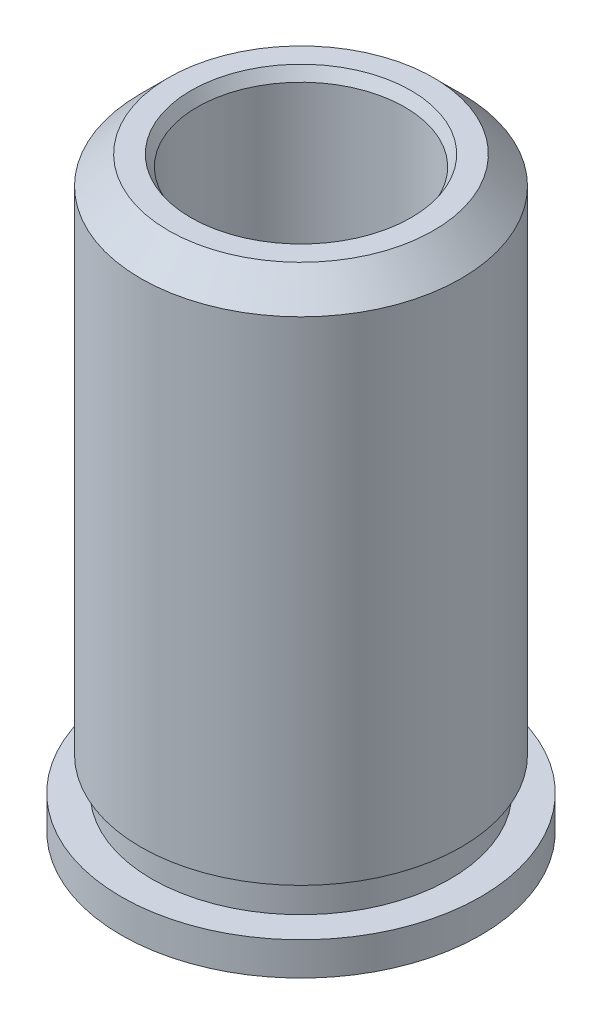
ISO-10303-21;
HEADER;
FILE_DESCRIPTION(('STEP AP214'),'2;1');
FILE_NAME('part.step','',(''),(''),'','','');
FILE_SCHEMA(('AUTOMOTIVE_DESIGN { 1 0 10303 214 1 1 1 1 }'));
ENDSEC;
DATA;
#1=APPLICATION_CONTEXT('core data for automotive mechanical design processes');
#2=APPLICATION_PROTOCOL_DEFINITION('international standard','automotive_design',2000,#1);
#3=PRODUCT_CONTEXT('',#1,'mechanical');
#4=PRODUCT('Part','Part','',(#3));
#5=PRODUCT_RELATED_PRODUCT_CATEGORY('part','',(#4));
#6=PRODUCT_DEFINITION_FORMATION('','',#4);
#7=PRODUCT_DEFINITION_CONTEXT('part definition',#1,'design');
#8=PRODUCT_DEFINITION('design','',#6,#7);
#9=PRODUCT_DEFINITION_SHAPE('','',#8);
#10=(LENGTH_UNIT() NAMED_UNIT(*) SI_UNIT(.MILLI.,.METRE.));
#11=(NAMED_UNIT(*) PLANE_ANGLE_UNIT() SI_UNIT($,.RADIAN.));
#12=(NAMED_UNIT(*) SI_UNIT($,.STERADIAN.) SOLID_ANGLE_UNIT());
#13=UNCERTAINTY_MEASURE_WITH_UNIT(LENGTH_MEASURE(1.E-05),#10,'distance_accuracy_value','');
#14=(GEOMETRIC_REPRESENTATION_CONTEXT(3) GLOBAL_UNCERTAINTY_ASSIGNED_CONTEXT((#13)) GLOBAL_UNIT_ASSIGNED_CONTEXT((#10,
#11,#12)) REPRESENTATION_CONTEXT('',''));
#15=CARTESIAN_POINT('',(0.,0.,0.));
#16=DIRECTION('',(0.,0.,1.));
#17=DIRECTION('',(1.,0.,0.));
#18=AXIS2_PLACEMENT_3D('',#15,#16,#17);
#19=CARTESIAN_POINT('',(0.,6.731,0.));
#20=DIRECTION('',(0.,1.,0.));
#21=DIRECTION('',(0.,0.,1.));
#22=AXIS2_PLACEMENT_3D('',#19,#20,#21);
#23=CYLINDRICAL_SURFACE('',#22,4.1275);
#24=CARTESIAN_POINT('',(0.,-6.731,0.));
#25=DIRECTION('',(0.,1.,0.));
#26=DIRECTION('',(0.,0.,1.));
#27=AXIS2_PLACEMENT_3D('',#24,#25,#26);
#28=CIRCLE('',#27,4.1275);
#29=CARTESIAN_POINT('',(0.,-6.731,4.1275));
#30=VERTEX_POINT('',#29);
#31=EDGE_CURVE('E51',#30,#30,#28,.T.);
#32=ORIENTED_EDGE('',*,*,#31,.T.);
#33=EDGE_LOOP('',(#32));
#34=FACE_BOUND('',#33,.T.);
#35=CARTESIAN_POINT('',(0.,-5.969,0.));
#36=DIRECTION('',(0.,1.,0.));
#37=DIRECTION('',(0.,0.,1.));
#38=AXIS2_PLACEMENT_3D('',#35,#36,#37);
#39=CIRCLE('',#38,4.1275);
#40=CARTESIAN_POINT('',(0.,-5.969,4.1275));
#41=VERTEX_POINT('',#40);
#42=EDGE_CURVE('E9',#41,#41,#39,.T.);
#43=ORIENTED_EDGE('',*,*,#42,.F.);
#44=EDGE_LOOP('',(#43));
#45=FACE_BOUND('',#44,.T.);
#46=ADVANCED_FACE('F14',(#34,#45),#23,.T.);
#47=CARTESIAN_POINT('',(2.06375,-5.969,0.));
#48=DIRECTION('',(0.,1.,0.));
#49=DIRECTION('',(0.,0.,1.));
#50=AXIS2_PLACEMENT_3D('',#47,#48,#49);
#51=PLANE('',#50);
#52=ORIENTED_EDGE('',*,*,#42,.T.);
#53=EDGE_LOOP('',(#52));
#54=FACE_BOUND('',#53,.T.);
#55=CARTESIAN_POINT('',(0.,-5.969,0.));
#56=DIRECTION('',(0.,1.,0.));
#57=DIRECTION('',(0.,0.,1.));
#58=AXIS2_PLACEMENT_3D('',#55,#56,#57);
#59=CIRCLE('',#58,3.42265);
#60=CARTESIAN_POINT('',(0.,-5.969,3.42265));
#61=VERTEX_POINT('',#60);
#62=EDGE_CURVE('E20',#61,#61,#59,.T.);
#63=ORIENTED_EDGE('',*,*,#62,.F.);
#64=EDGE_LOOP('',(#63));
#65=FACE_BOUND('',#64,.T.);
#66=ADVANCED_FACE('F77',(#54,#65),#51,.T.);
#67=CARTESIAN_POINT('',(0.,6.731,0.));
#68=DIRECTION('',(0.,1.,0.));
#69=DIRECTION('',(0.,0.,1.));
#70=AXIS2_PLACEMENT_3D('',#67,#68,#69);
#71=CYLINDRICAL_SURFACE('',#70,3.42265);
#72=ORIENTED_EDGE('',*,*,#62,.T.);
#73=EDGE_LOOP('',(#72));
#74=FACE_BOUND('',#73,.T.);
#75=CARTESIAN_POINT('',(0.,-5.207,0.));
#76=DIRECTION('',(0.,1.,0.));
#77=DIRECTION('',(0.,0.,1.));
#78=AXIS2_PLACEMENT_3D('',#75,#76,#77);
#79=CIRCLE('',#78,3.42265);
#80=CARTESIAN_POINT('',(0.,-5.207,3.42265));
#81=VERTEX_POINT('',#80);
#82=EDGE_CURVE('E24',#81,#81,#79,.T.);
#83=ORIENTED_EDGE('',*,*,#82,.F.);
#84=EDGE_LOOP('',(#83));
#85=FACE_BOUND('',#84,.T.);
#86=ADVANCED_FACE('F82',(#74,#85),#71,.T.);
#87=CARTESIAN_POINT('',(2.06375,-5.207,0.));
#88=DIRECTION('',(0.,-1.,0.));
#89=DIRECTION('',(0.,0.,-1.));
#90=AXIS2_PLACEMENT_3D('',#87,#88,#89);
#91=PLANE('',#90);
#92=ORIENTED_EDGE('',*,*,#82,.T.);
#93=EDGE_LOOP('',(#92));
#94=FACE_BOUND('',#93,.T.);
#95=CARTESIAN_POINT('',(0.,-5.207,0.));
#96=DIRECTION('',(0.,1.,0.));
#97=DIRECTION('',(0.,0.,1.));
#98=AXIS2_PLACEMENT_3D('',#95,#96,#97);
#99=CIRCLE('',#98,3.67665);
#100=CARTESIAN_POINT('',(0.,-5.207,3.67665));
#101=VERTEX_POINT('',#100);
#102=EDGE_CURVE('E28',#101,#101,#99,.T.);
#103=ORIENTED_EDGE('',*,*,#102,.F.);
#104=EDGE_LOOP('',(#103));
#105=FACE_BOUND('',#104,.T.);
#106=ADVANCED_FACE('F87',(#94,#105),#91,.T.);
#107=CARTESIAN_POINT('',(0.,6.731,0.));
#108=DIRECTION('',(0.,1.,0.));
#109=DIRECTION('',(0.,0.,1.));
#110=AXIS2_PLACEMENT_3D('',#107,#108,#109);
#111=CYLINDRICAL_SURFACE('',#110,3.67665);
#112=ORIENTED_EDGE('',*,*,#102,.T.);
#113=EDGE_LOOP('',(#112));
#114=FACE_BOUND('',#113,.T.);
#115=CARTESIAN_POINT('',(0.,6.096,0.));
#116=DIRECTION('',(0.,1.,0.));
#117=DIRECTION('',(0.,0.,1.));
#118=AXIS2_PLACEMENT_3D('',#115,#116,#117);
#119=CIRCLE('',#118,3.67665);
#120=CARTESIAN_POINT('',(0.,6.096,3.67665));
#121=VERTEX_POINT('',#120);
#122=EDGE_CURVE('E33',#121,#121,#119,.T.);
#123=ORIENTED_EDGE('',*,*,#122,.F.);
#124=EDGE_LOOP('',(#123));
#125=FACE_BOUND('',#124,.T.);
#126=ADVANCED_FACE('F93',(#114,#125),#111,.T.);
#127=CARTESIAN_POINT('',(0.,6.731,0.));
#128=DIRECTION('',(0.,-1.,0.));
#129=DIRECTION('',(0.,0.,-1.));
#130=AXIS2_PLACEMENT_3D('',#127,#128,#129);
#131=CONICAL_SURFACE('',#130,3.04165,0.785398163397448);
#132=ORIENTED_EDGE('',*,*,#122,.T.);
#133=EDGE_LOOP('',(#132));
#134=FACE_BOUND('',#133,.T.);
#135=CARTESIAN_POINT('',(0.,6.731,0.));
#136=DIRECTION('',(0.,1.,0.));
#137=DIRECTION('',(0.,0.,1.));
#138=AXIS2_PLACEMENT_3D('',#135,#136,#137);
#139=CIRCLE('',#138,3.04165);
#140=CARTESIAN_POINT('',(0.,6.731,3.04165));
#141=VERTEX_POINT('',#140);
#142=EDGE_CURVE('E36',#141,#141,#139,.T.);
#143=ORIENTED_EDGE('',*,*,#142,.F.);
#144=EDGE_LOOP('',(#143));
#145=FACE_BOUND('',#144,.T.);
#146=ADVANCED_FACE('F97',(#134,#145),#131,.T.);
#147=CARTESIAN_POINT('',(2.06375,6.731,0.));
#148=DIRECTION('',(0.,1.,0.));
#149=DIRECTION('',(0.,0.,1.));
#150=AXIS2_PLACEMENT_3D('',#147,#148,#149);
#151=PLANE('',#150);
#152=ORIENTED_EDGE('',*,*,#142,.T.);
#153=EDGE_LOOP('',(#152));
#154=FACE_BOUND('',#153,.T.);
#155=CARTESIAN_POINT('',(0.,6.731,0.));
#156=DIRECTION('',(0.,1.,0.));
#157=DIRECTION('',(0.,0.,1.));
#158=AXIS2_PLACEMENT_3D('',#155,#156,#157);
#159=CIRCLE('',#158,2.52789696837416);
#160=CARTESIAN_POINT('',(0.,6.731,2.52789696837416));
#161=VERTEX_POINT('',#160);
#162=EDGE_CURVE('E39',#161,#161,#159,.T.);
#163=ORIENTED_EDGE('',*,*,#162,.F.);
#164=EDGE_LOOP('',(#163));
#165=FACE_BOUND('',#164,.T.);
#166=ADVANCED_FACE('F101',(#154,#165),#151,.T.);
#167=CARTESIAN_POINT('',(0.,6.477,0.));
#168=DIRECTION('',(0.,1.,0.));
#169=DIRECTION('',(0.,0.,1.));
#170=AXIS2_PLACEMENT_3D('',#167,#168,#169);
#171=CONICAL_SURFACE('',#170,2.38125,0.523598775598291);
#172=ORIENTED_EDGE('',*,*,#162,.T.);
#173=EDGE_LOOP('',(#172));
#174=FACE_BOUND('',#173,.T.);
#175=CARTESIAN_POINT('',(0.,6.477,0.));
#176=DIRECTION('',(0.,1.,0.));
#177=DIRECTION('',(0.,0.,1.));
#178=AXIS2_PLACEMENT_3D('',#175,#176,#177);
#179=CIRCLE('',#178,2.38125);
#180=CARTESIAN_POINT('',(0.,6.477,2.38125));
#181=VERTEX_POINT('',#180);
#182=EDGE_CURVE('E42',#181,#181,#179,.T.);
#183=ORIENTED_EDGE('',*,*,#182,.F.);
#184=EDGE_LOOP('',(#183));
#185=FACE_BOUND('',#184,.T.);
#186=ADVANCED_FACE('F73',(#174,#185),#171,.F.);
#187=CARTESIAN_POINT('',(0.,6.731,0.));
#188=DIRECTION('',(0.,1.,0.));
#189=DIRECTION('',(0.,0.,1.));
#190=AXIS2_PLACEMENT_3D('',#187,#188,#189);
#191=CYLINDRICAL_SURFACE('',#190,2.38125);
#192=ORIENTED_EDGE('',*,*,#182,.T.);
#193=EDGE_LOOP('',(#192));
#194=FACE_BOUND('',#193,.T.);
#195=CARTESIAN_POINT('',(0.,-6.477,0.));
#196=DIRECTION('',(0.,1.,0.));
#197=DIRECTION('',(0.,0.,1.));
#198=AXIS2_PLACEMENT_3D('',#195,#196,#197);
#199=CIRCLE('',#198,2.38125);
#200=CARTESIAN_POINT('',(0.,-6.477,2.38125));
#201=VERTEX_POINT('',#200);
#202=EDGE_CURVE('E45',#201,#201,#199,.T.);
#203=ORIENTED_EDGE('',*,*,#202,.F.);
#204=EDGE_LOOP('',(#203));
#205=FACE_BOUND('',#204,.T.);
#206=ADVANCED_FACE('F65',(#194,#205),#191,.F.);
#207=CARTESIAN_POINT('',(0.,-6.731,0.));
#208=DIRECTION('',(0.,-1.,0.));
#209=DIRECTION('',(0.,0.,-1.));
#210=AXIS2_PLACEMENT_3D('',#207,#208,#209);
#211=CONICAL_SURFACE('',#210,2.52789696837417,0.523598775598301);
#212=ORIENTED_EDGE('',*,*,#202,.T.);
#213=EDGE_LOOP('',(#212));
#214=FACE_BOUND('',#213,.T.);
#215=CARTESIAN_POINT('',(0.,-6.731,0.));
#216=DIRECTION('',(0.,1.,0.));
#217=DIRECTION('',(0.,0.,1.));
#218=AXIS2_PLACEMENT_3D('',#215,#216,#217);
#219=CIRCLE('',#218,2.52789696837417);
#220=CARTESIAN_POINT('',(0.,-6.731,2.52789696837417));
#221=VERTEX_POINT('',#220);
#222=EDGE_CURVE('E48',#221,#221,#219,.T.);
#223=ORIENTED_EDGE('',*,*,#222,.F.);
#224=EDGE_LOOP('',(#223));
#225=FACE_BOUND('',#224,.T.);
#226=ADVANCED_FACE('F60',(#214,#225),#211,.F.);
#227=CARTESIAN_POINT('',(2.06375,-6.731,0.));
#228=DIRECTION('',(0.,1.,0.));
#229=DIRECTION('',(0.,0.,1.));
#230=AXIS2_PLACEMENT_3D('',#227,#228,#229);
#231=PLANE('',#230);
#232=ORIENTED_EDGE('',*,*,#31,.F.);
#233=EDGE_LOOP('',(#232));
#234=FACE_BOUND('',#233,.T.);
#235=ORIENTED_EDGE('',*,*,#222,.T.);
#236=EDGE_LOOP('',(#235));
#237=FACE_BOUND('',#236,.T.);
#238=ADVANCED_FACE('F57',(#234,#237),#231,.F.);
#239=CLOSED_SHELL('',(#46,#66,#86,#106,#126,#146,#166,#186,#206,#226,#238));
#240=MANIFOLD_SOLID_BREP('B1',#239);
#241=ADVANCED_BREP_SHAPE_REPRESENTATION('',(#18,#240),#14);
#242=SHAPE_DEFINITION_REPRESENTATION(#9,#241);
ENDSEC;
END-ISO-10303-21;
